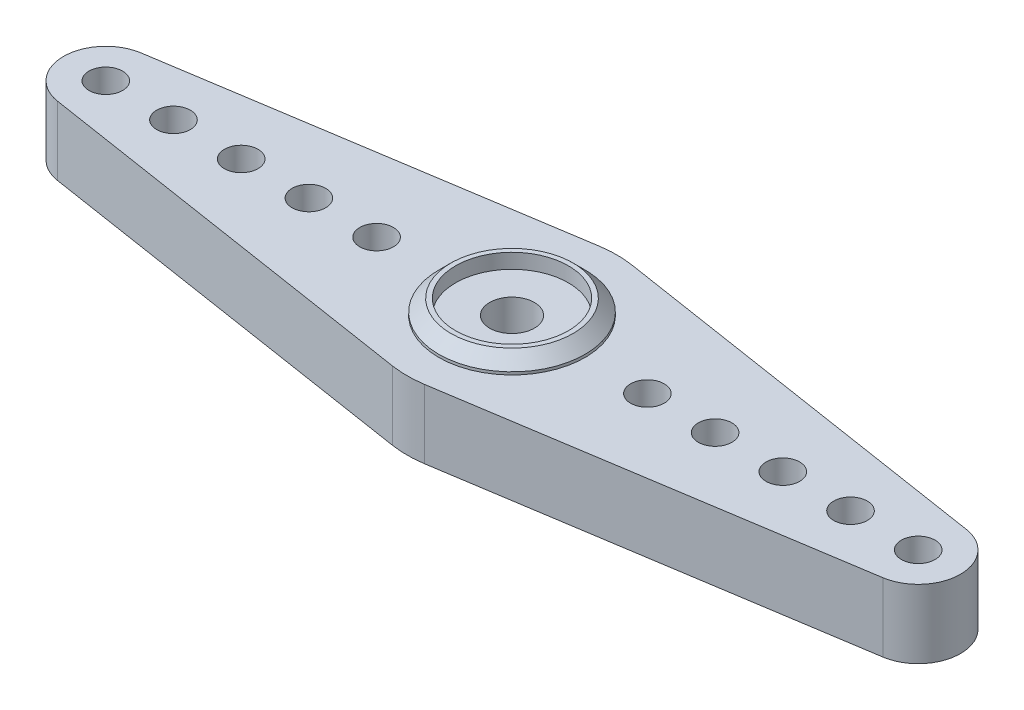
ISO-10303-21;
HEADER;
FILE_DESCRIPTION(('STEP AP214'),'2;1');
FILE_NAME('part.step','',(''),(''),'','','');
FILE_SCHEMA(('AUTOMOTIVE_DESIGN { 1 0 10303 214 1 1 1 1 }'));
ENDSEC;
DATA;
#1=APPLICATION_CONTEXT('core data for automotive mechanical design processes');
#2=APPLICATION_PROTOCOL_DEFINITION('international standard','automotive_design',2000,#1);
#3=PRODUCT_CONTEXT('',#1,'mechanical');
#4=PRODUCT('Part','Part','',(#3));
#5=PRODUCT_RELATED_PRODUCT_CATEGORY('part','',(#4));
#6=PRODUCT_DEFINITION_FORMATION('','',#4);
#7=PRODUCT_DEFINITION_CONTEXT('part definition',#1,'design');
#8=PRODUCT_DEFINITION('design','',#6,#7);
#9=PRODUCT_DEFINITION_SHAPE('','',#8);
#10=(LENGTH_UNIT() NAMED_UNIT(*) SI_UNIT(.MILLI.,.METRE.));
#11=(NAMED_UNIT(*) PLANE_ANGLE_UNIT() SI_UNIT($,.RADIAN.));
#12=(NAMED_UNIT(*) SI_UNIT($,.STERADIAN.) SOLID_ANGLE_UNIT());
#13=UNCERTAINTY_MEASURE_WITH_UNIT(LENGTH_MEASURE(1.E-05),#10,'distance_accuracy_value','');
#14=(GEOMETRIC_REPRESENTATION_CONTEXT(3) GLOBAL_UNCERTAINTY_ASSIGNED_CONTEXT((#13)) GLOBAL_UNIT_ASSIGNED_CONTEXT((#10,
#11,#12)) REPRESENTATION_CONTEXT('',''));
#15=CARTESIAN_POINT('',(0.,0.,0.));
#16=DIRECTION('',(0.,0.,1.));
#17=DIRECTION('',(1.,0.,0.));
#18=AXIS2_PLACEMENT_3D('',#15,#16,#17);
#19=CARTESIAN_POINT('',(-30.0228,0.,0.));
#20=DIRECTION('',(0.,1.,0.));
#21=DIRECTION('',(0.,0.,1.));
#22=AXIS2_PLACEMENT_3D('',#19,#20,#21);
#23=PLANE('',#22);
#24=CARTESIAN_POINT('',(0.,0.,0.));
#25=DIRECTION('',(0.,1.,0.));
#26=DIRECTION('',(0.,0.,1.));
#27=AXIS2_PLACEMENT_3D('',#24,#25,#26);
#28=CIRCLE('',#27,1.651);
#29=CARTESIAN_POINT('',(0.,0.,1.651));
#30=VERTEX_POINT('',#29);
#31=EDGE_CURVE('E301',#30,#30,#28,.T.);
#32=ORIENTED_EDGE('',*,*,#31,.T.);
#33=EDGE_LOOP('',(#32));
#34=FACE_BOUND('',#33,.T.);
#35=CARTESIAN_POINT('',(0.,0.,0.));
#36=DIRECTION('',(0.,-1.,0.));
#37=DIRECTION('',(0.,0.,-1.));
#38=AXIS2_PLACEMENT_3D('',#35,#36,#37);
#39=CIRCLE('',#38,4.1656);
#40=CARTESIAN_POINT('',(0.,0.,-4.1656));
#41=VERTEX_POINT('',#40);
#42=EDGE_CURVE('E373',#41,#41,#39,.T.);
#43=ORIENTED_EDGE('',*,*,#42,.T.);
#44=EDGE_LOOP('',(#43));
#45=FACE_BOUND('',#44,.T.);
#46=ADVANCED_FACE('F33',(#34,#45),#23,.F.);
#47=CARTESIAN_POINT('',(-30.0228,5.08,0.));
#48=DIRECTION('',(0.,1.,0.));
#49=DIRECTION('',(0.,0.,1.));
#50=AXIS2_PLACEMENT_3D('',#47,#48,#49);
#51=PLANE('',#50);
#52=CARTESIAN_POINT('',(0.,5.08,0.));
#53=DIRECTION('',(0.,1.,0.));
#54=DIRECTION('',(0.,0.,1.));
#55=AXIS2_PLACEMENT_3D('',#52,#53,#54);
#56=CIRCLE('',#55,1.651);
#57=CARTESIAN_POINT('',(0.,5.08,1.651));
#58=VERTEX_POINT('',#57);
#59=EDGE_CURVE('E136',#58,#58,#56,.T.);
#60=ORIENTED_EDGE('',*,*,#59,.F.);
#61=EDGE_LOOP('',(#60));
#62=FACE_BOUND('',#61,.T.);
#63=CARTESIAN_POINT('',(0.,5.08,0.));
#64=DIRECTION('',(0.,1.,0.));
#65=DIRECTION('',(0.,0.,1.));
#66=AXIS2_PLACEMENT_3D('',#63,#64,#65);
#67=CIRCLE('',#66,4.1656);
#68=CARTESIAN_POINT('',(0.,5.08,4.1656));
#69=VERTEX_POINT('',#68);
#70=EDGE_CURVE('E162',#69,#69,#67,.F.);
#71=ORIENTED_EDGE('',*,*,#70,.F.);
#72=EDGE_LOOP('',(#71));
#73=FACE_BOUND('',#72,.T.);
#74=ADVANCED_FACE('F190',(#62,#73),#51,.T.);
#75=CARTESIAN_POINT('',(0.,5.08,0.));
#76=DIRECTION('',(0.,1.,0.));
#77=DIRECTION('',(0.,0.,1.));
#78=AXIS2_PLACEMENT_3D('',#75,#76,#77);
#79=CIRCLE('',#78,5.40385);
#80=CARTESIAN_POINT('',(0.,5.08,5.40385));
#81=VERTEX_POINT('',#80);
#82=EDGE_CURVE('E258',#81,#81,#79,.T.);
#83=ORIENTED_EDGE('',*,*,#82,.F.);
#84=EDGE_LOOP('',(#83));
#85=FACE_BOUND('',#84,.T.);
#86=CARTESIAN_POINT('',(15.0114,5.08,0.));
#87=DIRECTION('',(0.,1.,0.));
#88=DIRECTION('',(0.,0.,-1.));
#89=AXIS2_PLACEMENT_3D('',#86,#87,#88);
#90=CIRCLE('',#89,1.2446);
#91=CARTESIAN_POINT('',(15.0114,5.08,-1.2446));
#92=VERTEX_POINT('',#91);
#93=EDGE_CURVE('E266',#92,#92,#90,.T.);
#94=ORIENTED_EDGE('',*,*,#93,.F.);
#95=EDGE_LOOP('',(#94));
#96=FACE_BOUND('',#95,.T.);
#97=CARTESIAN_POINT('',(25.019,5.08,0.));
#98=DIRECTION('',(0.,1.,0.));
#99=DIRECTION('',(0.,0.,-1.));
#100=AXIS2_PLACEMENT_3D('',#97,#98,#99);
#101=CIRCLE('',#100,1.2446);
#102=CARTESIAN_POINT('',(25.019,5.08,-1.2446));
#103=VERTEX_POINT('',#102);
#104=EDGE_CURVE('E274',#103,#103,#101,.T.);
#105=ORIENTED_EDGE('',*,*,#104,.F.);
#106=EDGE_LOOP('',(#105));
#107=FACE_BOUND('',#106,.T.);
#108=CARTESIAN_POINT('',(-30.0228,5.08,0.));
#109=DIRECTION('',(0.,1.,0.));
#110=DIRECTION('',(0.,0.,1.));
#111=AXIS2_PLACEMENT_3D('',#108,#109,#110);
#112=CIRCLE('',#111,1.2446);
#113=CARTESIAN_POINT('',(-30.0228,5.08,1.2446));
#114=VERTEX_POINT('',#113);
#115=EDGE_CURVE('E282',#114,#114,#112,.T.);
#116=ORIENTED_EDGE('',*,*,#115,.F.);
#117=EDGE_LOOP('',(#116));
#118=FACE_BOUND('',#117,.T.);
#119=CARTESIAN_POINT('',(-20.0152,5.08,0.));
#120=DIRECTION('',(0.,1.,0.));
#121=DIRECTION('',(0.,0.,1.));
#122=AXIS2_PLACEMENT_3D('',#119,#120,#121);
#123=CIRCLE('',#122,1.2446);
#124=CARTESIAN_POINT('',(-20.0152,5.08,1.2446));
#125=VERTEX_POINT('',#124);
#126=EDGE_CURVE('E290',#125,#125,#123,.T.);
#127=ORIENTED_EDGE('',*,*,#126,.F.);
#128=EDGE_LOOP('',(#127));
#129=FACE_BOUND('',#128,.T.);
#130=CARTESIAN_POINT('',(-10.0076,5.08,0.));
#131=DIRECTION('',(0.,1.,0.));
#132=DIRECTION('',(0.,0.,1.));
#133=AXIS2_PLACEMENT_3D('',#130,#131,#132);
#134=CIRCLE('',#133,1.2446);
#135=CARTESIAN_POINT('',(-10.0076,5.08,1.2446));
#136=VERTEX_POINT('',#135);
#137=EDGE_CURVE('E298',#136,#136,#134,.T.);
#138=ORIENTED_EDGE('',*,*,#137,.F.);
#139=EDGE_LOOP('',(#138));
#140=FACE_BOUND('',#139,.T.);
#141=CARTESIAN_POINT('',(-30.0228,5.08,0.));
#142=DIRECTION('',(0.,1.,0.));
#143=DIRECTION('',(0.,0.,1.));
#144=AXIS2_PLACEMENT_3D('',#141,#142,#143);
#145=CIRCLE('',#144,3.1242);
#146=CARTESIAN_POINT('',(-30.5038527918782,5.08,-3.08694247620946));
#147=VERTEX_POINT('',#146);
#148=CARTESIAN_POINT('',(-30.5038527918782,5.08,3.08694247620947));
#149=VERTEX_POINT('',#148);
#150=EDGE_CURVE('E147',#147,#149,#145,.T.);
#151=ORIENTED_EDGE('',*,*,#150,.T.);
#152=DIRECTION('',(0.988074539469133,0.,0.153976311336717));
#153=VECTOR('',#152,1.);
#154=CARTESIAN_POINT('',(-30.5038527918782,5.08,3.08694247620947));
#155=LINE('',#154,#153);
#156=CARTESIAN_POINT('',(-1.19285448392555,5.08,7.65461345726737));
#157=VERTEX_POINT('',#156);
#158=EDGE_CURVE('E94',#149,#157,#155,.T.);
#159=ORIENTED_EDGE('',*,*,#158,.T.);
#160=CARTESIAN_POINT('',(0.,5.08,0.));
#161=DIRECTION('',(0.,1.,0.));
#162=DIRECTION('',(0.,0.,1.));
#163=AXIS2_PLACEMENT_3D('',#160,#161,#162);
#164=CIRCLE('',#163,7.747);
#165=CARTESIAN_POINT('',(1.19285448392555,5.08,7.65461345726737));
#166=VERTEX_POINT('',#165);
#167=EDGE_CURVE('E308',#157,#166,#164,.T.);
#168=ORIENTED_EDGE('',*,*,#167,.T.);
#169=DIRECTION('',(0.988074539469133,0.,-0.153976311336717));
#170=VECTOR('',#169,1.);
#171=CARTESIAN_POINT('',(30.5038527918782,5.08,3.08694247620947));
#172=LINE('',#171,#170);
#173=CARTESIAN_POINT('',(30.5038527918782,5.08,3.08694247620947));
#174=VERTEX_POINT('',#173);
#175=EDGE_CURVE('E310',#166,#174,#172,.T.);
#176=ORIENTED_EDGE('',*,*,#175,.T.);
#177=CARTESIAN_POINT('',(30.0228,5.08,0.));
#178=DIRECTION('',(0.,1.,0.));
#179=DIRECTION('',(0.,0.,-1.));
#180=AXIS2_PLACEMENT_3D('',#177,#178,#179);
#181=CIRCLE('',#180,3.1242);
#182=CARTESIAN_POINT('',(30.5038527918782,5.08,-3.08694247620946));
#183=VERTEX_POINT('',#182);
#184=EDGE_CURVE('E114',#174,#183,#181,.T.);
#185=ORIENTED_EDGE('',*,*,#184,.T.);
#186=DIRECTION('',(-0.988074539469132,0.,-0.153976311336717));
#187=VECTOR('',#186,1.);
#188=CARTESIAN_POINT('',(30.5038527918782,5.08,-3.08694247620946));
#189=LINE('',#188,#187);
#190=CARTESIAN_POINT('',(1.19285448392555,5.08,-7.65461345726737));
#191=VERTEX_POINT('',#190);
#192=EDGE_CURVE('E107',#183,#191,#189,.T.);
#193=ORIENTED_EDGE('',*,*,#192,.T.);
#194=CARTESIAN_POINT('',(0.,5.08,0.));
#195=DIRECTION('',(0.,1.,0.));
#196=DIRECTION('',(0.,0.,1.));
#197=AXIS2_PLACEMENT_3D('',#194,#195,#196);
#198=CIRCLE('',#197,7.747);
#199=CARTESIAN_POINT('',(-1.19285448392555,5.08,-7.65461345726737));
#200=VERTEX_POINT('',#199);
#201=EDGE_CURVE('E112',#191,#200,#198,.T.);
#202=ORIENTED_EDGE('',*,*,#201,.T.);
#203=DIRECTION('',(-0.988074539469132,0.,0.153976311336717));
#204=VECTOR('',#203,1.);
#205=CARTESIAN_POINT('',(-30.5038527918782,5.08,-3.08694247620946));
#206=LINE('',#205,#204);
#207=EDGE_CURVE('E50',#200,#147,#206,.T.);
#208=ORIENTED_EDGE('',*,*,#207,.T.);
#209=EDGE_LOOP('',(#151,#159,#168,#176,#185,#193,#202,#208));
#210=FACE_BOUND('',#209,.T.);
#211=CARTESIAN_POINT('',(-15.0114,5.08,0.));
#212=DIRECTION('',(0.,1.,0.));
#213=DIRECTION('',(0.,0.,1.));
#214=AXIS2_PLACEMENT_3D('',#211,#212,#213);
#215=CIRCLE('',#214,1.2446);
#216=CARTESIAN_POINT('',(-15.0114,5.08,1.2446));
#217=VERTEX_POINT('',#216);
#218=EDGE_CURVE('E294',#217,#217,#215,.T.);
#219=ORIENTED_EDGE('',*,*,#218,.F.);
#220=EDGE_LOOP('',(#219));
#221=FACE_BOUND('',#220,.T.);
#222=CARTESIAN_POINT('',(-25.019,5.08,0.));
#223=DIRECTION('',(0.,1.,0.));
#224=DIRECTION('',(0.,0.,1.));
#225=AXIS2_PLACEMENT_3D('',#222,#223,#224);
#226=CIRCLE('',#225,1.2446);
#227=CARTESIAN_POINT('',(-25.019,5.08,1.2446));
#228=VERTEX_POINT('',#227);
#229=EDGE_CURVE('E286',#228,#228,#226,.T.);
#230=ORIENTED_EDGE('',*,*,#229,.F.);
#231=EDGE_LOOP('',(#230));
#232=FACE_BOUND('',#231,.T.);
#233=CARTESIAN_POINT('',(30.0228,5.08,0.));
#234=DIRECTION('',(0.,1.,0.));
#235=DIRECTION('',(0.,0.,-1.));
#236=AXIS2_PLACEMENT_3D('',#233,#234,#235);
#237=CIRCLE('',#236,1.2446);
#238=CARTESIAN_POINT('',(30.0228,5.08,-1.24459999999999));
#239=VERTEX_POINT('',#238);
#240=EDGE_CURVE('E278',#239,#239,#237,.T.);
#241=ORIENTED_EDGE('',*,*,#240,.F.);
#242=EDGE_LOOP('',(#241));
#243=FACE_BOUND('',#242,.T.);
#244=CARTESIAN_POINT('',(20.0152,5.08,0.));
#245=DIRECTION('',(0.,1.,0.));
#246=DIRECTION('',(0.,0.,-1.));
#247=AXIS2_PLACEMENT_3D('',#244,#245,#246);
#248=CIRCLE('',#247,1.2446);
#249=CARTESIAN_POINT('',(20.0152,5.08,-1.2446));
#250=VERTEX_POINT('',#249);
#251=EDGE_CURVE('E270',#250,#250,#248,.T.);
#252=ORIENTED_EDGE('',*,*,#251,.F.);
#253=EDGE_LOOP('',(#252));
#254=FACE_BOUND('',#253,.T.);
#255=CARTESIAN_POINT('',(10.0076,5.08,0.));
#256=DIRECTION('',(0.,1.,0.));
#257=DIRECTION('',(0.,0.,-1.));
#258=AXIS2_PLACEMENT_3D('',#255,#256,#257);
#259=CIRCLE('',#258,1.2446);
#260=CARTESIAN_POINT('',(10.0076,5.08,-1.2446));
#261=VERTEX_POINT('',#260);
#262=EDGE_CURVE('E257',#261,#261,#259,.T.);
#263=ORIENTED_EDGE('',*,*,#262,.F.);
#264=EDGE_LOOP('',(#263));
#265=FACE_BOUND('',#264,.T.);
#266=ADVANCED_FACE('F109',(#85,#96,#107,#118,#129,#140,#210,#221,#232,#243,#254,#265),#51,.T.);
#267=CARTESIAN_POINT('',(0.,0.,0.));
#268=DIRECTION('',(0.,1.,0.));
#269=DIRECTION('',(0.,0.,1.));
#270=AXIS2_PLACEMENT_3D('',#267,#268,#269);
#271=CIRCLE('',#270,5.4102);
#272=CARTESIAN_POINT('',(0.,0.,5.4102));
#273=VERTEX_POINT('',#272);
#274=EDGE_CURVE('E171',#273,#273,#271,.F.);
#275=ORIENTED_EDGE('',*,*,#274,.F.);
#276=EDGE_LOOP('',(#275));
#277=FACE_BOUND('',#276,.T.);
#278=CARTESIAN_POINT('',(-30.0228,0.,0.));
#279=DIRECTION('',(0.,1.,0.));
#280=DIRECTION('',(0.,0.,1.));
#281=AXIS2_PLACEMENT_3D('',#278,#279,#280);
#282=CIRCLE('',#281,3.1242);
#283=CARTESIAN_POINT('',(-30.5038527918782,0.,-3.08694247620946));
#284=VERTEX_POINT('',#283);
#285=CARTESIAN_POINT('',(-30.5038527918782,0.,3.08694247620947));
#286=VERTEX_POINT('',#285);
#287=EDGE_CURVE('E132',#284,#286,#282,.T.);
#288=ORIENTED_EDGE('',*,*,#287,.F.);
#289=DIRECTION('',(-0.988074539469132,0.,0.153976311336717));
#290=VECTOR('',#289,1.);
#291=CARTESIAN_POINT('',(-30.5038527918782,0.,-3.08694247620946));
#292=LINE('',#291,#290);
#293=CARTESIAN_POINT('',(-1.19285448392555,0.,-7.65461345726737));
#294=VERTEX_POINT('',#293);
#295=EDGE_CURVE('E85',#294,#284,#292,.T.);
#296=ORIENTED_EDGE('',*,*,#295,.F.);
#297=CARTESIAN_POINT('',(0.,0.,0.));
#298=DIRECTION('',(0.,1.,0.));
#299=DIRECTION('',(0.,0.,1.));
#300=AXIS2_PLACEMENT_3D('',#297,#298,#299);
#301=CIRCLE('',#300,7.747);
#302=CARTESIAN_POINT('',(1.19285448392555,0.,-7.65461345726737));
#303=VERTEX_POINT('',#302);
#304=EDGE_CURVE('E79',#303,#294,#301,.T.);
#305=ORIENTED_EDGE('',*,*,#304,.F.);
#306=DIRECTION('',(-0.988074539469132,0.,-0.153976311336717));
#307=VECTOR('',#306,1.);
#308=CARTESIAN_POINT('',(30.5038527918782,0.,-3.08694247620946));
#309=LINE('',#308,#307);
#310=CARTESIAN_POINT('',(30.5038527918782,0.,-3.08694247620946));
#311=VERTEX_POINT('',#310);
#312=EDGE_CURVE('E122',#311,#303,#309,.T.);
#313=ORIENTED_EDGE('',*,*,#312,.F.);
#314=CARTESIAN_POINT('',(30.0228,0.,0.));
#315=DIRECTION('',(0.,1.,0.));
#316=DIRECTION('',(0.,0.,-1.));
#317=AXIS2_PLACEMENT_3D('',#314,#315,#316);
#318=CIRCLE('',#317,3.1242);
#319=CARTESIAN_POINT('',(30.5038527918782,0.,3.08694247620947));
#320=VERTEX_POINT('',#319);
#321=EDGE_CURVE('E142',#320,#311,#318,.T.);
#322=ORIENTED_EDGE('',*,*,#321,.F.);
#323=DIRECTION('',(0.988074539469133,0.,-0.153976311336717));
#324=VECTOR('',#323,1.);
#325=CARTESIAN_POINT('',(30.5038527918782,0.,3.08694247620947));
#326=LINE('',#325,#324);
#327=CARTESIAN_POINT('',(1.19285448392555,0.,7.65461345726737));
#328=VERTEX_POINT('',#327);
#329=EDGE_CURVE('E140',#328,#320,#326,.T.);
#330=ORIENTED_EDGE('',*,*,#329,.F.);
#331=CARTESIAN_POINT('',(0.,0.,0.));
#332=DIRECTION('',(0.,1.,0.));
#333=DIRECTION('',(0.,0.,1.));
#334=AXIS2_PLACEMENT_3D('',#331,#332,#333);
#335=CIRCLE('',#334,7.747);
#336=CARTESIAN_POINT('',(-1.19285448392555,0.,7.65461345726737));
#337=VERTEX_POINT('',#336);
#338=EDGE_CURVE('E138',#337,#328,#335,.T.);
#339=ORIENTED_EDGE('',*,*,#338,.F.);
#340=DIRECTION('',(0.988074539469133,0.,0.153976311336717));
#341=VECTOR('',#340,1.);
#342=CARTESIAN_POINT('',(-30.5038527918782,0.,3.08694247620947));
#343=LINE('',#342,#341);
#344=EDGE_CURVE('E135',#286,#337,#343,.T.);
#345=ORIENTED_EDGE('',*,*,#344,.F.);
#346=EDGE_LOOP('',(#288,#296,#305,#313,#322,#330,#339,#345));
#347=FACE_BOUND('',#346,.T.);
#348=CARTESIAN_POINT('',(-10.0076,0.,0.));
#349=DIRECTION('',(0.,1.,0.));
#350=DIRECTION('',(0.,0.,1.));
#351=AXIS2_PLACEMENT_3D('',#348,#349,#350);
#352=CIRCLE('',#351,1.2446);
#353=CARTESIAN_POINT('',(-10.0076,0.,1.2446));
#354=VERTEX_POINT('',#353);
#355=EDGE_CURVE('E220',#354,#354,#352,.T.);
#356=ORIENTED_EDGE('',*,*,#355,.T.);
#357=EDGE_LOOP('',(#356));
#358=FACE_BOUND('',#357,.T.);
#359=CARTESIAN_POINT('',(-15.0114,0.,0.));
#360=DIRECTION('',(0.,1.,0.));
#361=DIRECTION('',(0.,0.,1.));
#362=AXIS2_PLACEMENT_3D('',#359,#360,#361);
#363=CIRCLE('',#362,1.2446);
#364=CARTESIAN_POINT('',(-15.0114,0.,1.2446));
#365=VERTEX_POINT('',#364);
#366=EDGE_CURVE('E224',#365,#365,#363,.T.);
#367=ORIENTED_EDGE('',*,*,#366,.T.);
#368=EDGE_LOOP('',(#367));
#369=FACE_BOUND('',#368,.T.);
#370=CARTESIAN_POINT('',(-20.0152,0.,0.));
#371=DIRECTION('',(0.,1.,0.));
#372=DIRECTION('',(0.,0.,1.));
#373=AXIS2_PLACEMENT_3D('',#370,#371,#372);
#374=CIRCLE('',#373,1.2446);
#375=CARTESIAN_POINT('',(-20.0152,0.,1.2446));
#376=VERTEX_POINT('',#375);
#377=EDGE_CURVE('E228',#376,#376,#374,.T.);
#378=ORIENTED_EDGE('',*,*,#377,.T.);
#379=EDGE_LOOP('',(#378));
#380=FACE_BOUND('',#379,.T.);
#381=CARTESIAN_POINT('',(-25.019,0.,0.));
#382=DIRECTION('',(0.,1.,0.));
#383=DIRECTION('',(0.,0.,1.));
#384=AXIS2_PLACEMENT_3D('',#381,#382,#383);
#385=CIRCLE('',#384,1.2446);
#386=CARTESIAN_POINT('',(-25.019,0.,1.2446));
#387=VERTEX_POINT('',#386);
#388=EDGE_CURVE('E232',#387,#387,#385,.T.);
#389=ORIENTED_EDGE('',*,*,#388,.T.);
#390=EDGE_LOOP('',(#389));
#391=FACE_BOUND('',#390,.T.);
#392=CARTESIAN_POINT('',(-30.0228,0.,0.));
#393=DIRECTION('',(0.,1.,0.));
#394=DIRECTION('',(0.,0.,1.));
#395=AXIS2_PLACEMENT_3D('',#392,#393,#394);
#396=CIRCLE('',#395,1.2446);
#397=CARTESIAN_POINT('',(-30.0228,0.,1.2446));
#398=VERTEX_POINT('',#397);
#399=EDGE_CURVE('E236',#398,#398,#396,.T.);
#400=ORIENTED_EDGE('',*,*,#399,.T.);
#401=EDGE_LOOP('',(#400));
#402=FACE_BOUND('',#401,.T.);
#403=CARTESIAN_POINT('',(30.0228,0.,0.));
#404=DIRECTION('',(0.,1.,0.));
#405=DIRECTION('',(0.,0.,-1.));
#406=AXIS2_PLACEMENT_3D('',#403,#404,#405);
#407=CIRCLE('',#406,1.2446);
#408=CARTESIAN_POINT('',(30.0228,0.,-1.24459999999999));
#409=VERTEX_POINT('',#408);
#410=EDGE_CURVE('E240',#409,#409,#407,.T.);
#411=ORIENTED_EDGE('',*,*,#410,.T.);
#412=EDGE_LOOP('',(#411));
#413=FACE_BOUND('',#412,.T.);
#414=CARTESIAN_POINT('',(25.019,0.,0.));
#415=DIRECTION('',(0.,1.,0.));
#416=DIRECTION('',(0.,0.,-1.));
#417=AXIS2_PLACEMENT_3D('',#414,#415,#416);
#418=CIRCLE('',#417,1.2446);
#419=CARTESIAN_POINT('',(25.019,0.,-1.2446));
#420=VERTEX_POINT('',#419);
#421=EDGE_CURVE('E244',#420,#420,#418,.T.);
#422=ORIENTED_EDGE('',*,*,#421,.T.);
#423=EDGE_LOOP('',(#422));
#424=FACE_BOUND('',#423,.T.);
#425=CARTESIAN_POINT('',(20.0152,0.,0.));
#426=DIRECTION('',(0.,1.,0.));
#427=DIRECTION('',(0.,0.,-1.));
#428=AXIS2_PLACEMENT_3D('',#425,#426,#427);
#429=CIRCLE('',#428,1.2446);
#430=CARTESIAN_POINT('',(20.0152,0.,-1.2446));
#431=VERTEX_POINT('',#430);
#432=EDGE_CURVE('E248',#431,#431,#429,.T.);
#433=ORIENTED_EDGE('',*,*,#432,.T.);
#434=EDGE_LOOP('',(#433));
#435=FACE_BOUND('',#434,.T.);
#436=CARTESIAN_POINT('',(15.0114,0.,0.));
#437=DIRECTION('',(0.,1.,0.));
#438=DIRECTION('',(0.,0.,-1.));
#439=AXIS2_PLACEMENT_3D('',#436,#437,#438);
#440=CIRCLE('',#439,1.2446);
#441=CARTESIAN_POINT('',(15.0114,0.,-1.2446));
#442=VERTEX_POINT('',#441);
#443=EDGE_CURVE('E252',#442,#442,#440,.T.);
#444=ORIENTED_EDGE('',*,*,#443,.T.);
#445=EDGE_LOOP('',(#444));
#446=FACE_BOUND('',#445,.T.);
#447=CARTESIAN_POINT('',(10.0076,0.,0.));
#448=DIRECTION('',(0.,1.,0.));
#449=DIRECTION('',(0.,0.,-1.));
#450=AXIS2_PLACEMENT_3D('',#447,#448,#449);
#451=CIRCLE('',#450,1.2446);
#452=CARTESIAN_POINT('',(10.0076,0.,-1.2446));
#453=VERTEX_POINT('',#452);
#454=EDGE_CURVE('E255',#453,#453,#451,.T.);
#455=ORIENTED_EDGE('',*,*,#454,.T.);
#456=EDGE_LOOP('',(#455));
#457=FACE_BOUND('',#456,.T.);
#458=ADVANCED_FACE('F193',(#277,#347,#358,#369,#380,#391,#402,#413,#424,#435,#446,#457),#23,.F.);
#459=CARTESIAN_POINT('',(-30.0228,5.08,0.));
#460=DIRECTION('',(0.,-1.,0.));
#461=DIRECTION('',(0.,0.,-1.));
#462=AXIS2_PLACEMENT_3D('',#459,#460,#461);
#463=CYLINDRICAL_SURFACE('',#462,3.1242);
#464=ORIENTED_EDGE('',*,*,#287,.T.);
#465=DIRECTION('',(0.,-1.,0.));
#466=VECTOR('',#465,1.);
#467=CARTESIAN_POINT('',(-30.5038527918782,5.08,3.08694247620947));
#468=LINE('',#467,#466);
#469=EDGE_CURVE('E160',#149,#286,#468,.T.);
#470=ORIENTED_EDGE('',*,*,#469,.F.);
#471=ORIENTED_EDGE('',*,*,#150,.F.);
#472=DIRECTION('',(0.,-1.,0.));
#473=VECTOR('',#472,1.);
#474=CARTESIAN_POINT('',(-30.5038527918782,5.08,-3.08694247620946));
#475=LINE('',#474,#473);
#476=EDGE_CURVE('E128',#147,#284,#475,.T.);
#477=ORIENTED_EDGE('',*,*,#476,.T.);
#478=EDGE_LOOP('',(#464,#470,#471,#477));
#479=FACE_BOUND('',#478,.T.);
#480=ADVANCED_FACE('F203',(#479),#463,.T.);
#481=CARTESIAN_POINT('',(-30.5038527918782,5.08,3.08694247620947));
#482=DIRECTION('',(0.153976311336717,0.,-0.988074539469132));
#483=DIRECTION('',(-0.988074539469133,0.,-0.153976311336717));
#484=AXIS2_PLACEMENT_3D('',#481,#482,#483);
#485=PLANE('',#484);
#486=ORIENTED_EDGE('',*,*,#344,.T.);
#487=DIRECTION('',(0.,-1.,0.));
#488=VECTOR('',#487,1.);
#489=CARTESIAN_POINT('',(-1.19285448392555,5.08,7.65461345726737));
#490=LINE('',#489,#488);
#491=EDGE_CURVE('E157',#157,#337,#490,.T.);
#492=ORIENTED_EDGE('',*,*,#491,.F.);
#493=ORIENTED_EDGE('',*,*,#158,.F.);
#494=ORIENTED_EDGE('',*,*,#469,.T.);
#495=EDGE_LOOP('',(#486,#492,#493,#494));
#496=FACE_BOUND('',#495,.T.);
#497=ADVANCED_FACE('F209',(#496),#485,.F.);
#498=CARTESIAN_POINT('',(0.,5.08,0.));
#499=DIRECTION('',(0.,-1.,0.));
#500=DIRECTION('',(0.,0.,-1.));
#501=AXIS2_PLACEMENT_3D('',#498,#499,#500);
#502=CYLINDRICAL_SURFACE('',#501,7.747);
#503=ORIENTED_EDGE('',*,*,#338,.T.);
#504=DIRECTION('',(0.,-1.,0.));
#505=VECTOR('',#504,1.);
#506=CARTESIAN_POINT('',(1.19285448392555,5.08,7.65461345726737));
#507=LINE('',#506,#505);
#508=EDGE_CURVE('E154',#166,#328,#507,.T.);
#509=ORIENTED_EDGE('',*,*,#508,.F.);
#510=ORIENTED_EDGE('',*,*,#167,.F.);
#511=ORIENTED_EDGE('',*,*,#491,.T.);
#512=EDGE_LOOP('',(#503,#509,#510,#511));
#513=FACE_BOUND('',#512,.T.);
#514=ADVANCED_FACE('F323',(#513),#502,.T.);
#515=CARTESIAN_POINT('',(30.5038527918782,5.08,3.08694247620947));
#516=DIRECTION('',(-0.153976311336717,0.,-0.988074539469132));
#517=DIRECTION('',(-0.988074539469133,0.,0.153976311336717));
#518=AXIS2_PLACEMENT_3D('',#515,#516,#517);
#519=PLANE('',#518);
#520=ORIENTED_EDGE('',*,*,#329,.T.);
#521=DIRECTION('',(0.,-1.,0.));
#522=VECTOR('',#521,1.);
#523=CARTESIAN_POINT('',(30.5038527918782,5.08,3.08694247620947));
#524=LINE('',#523,#522);
#525=EDGE_CURVE('E151',#174,#320,#524,.T.);
#526=ORIENTED_EDGE('',*,*,#525,.F.);
#527=ORIENTED_EDGE('',*,*,#175,.F.);
#528=ORIENTED_EDGE('',*,*,#508,.T.);
#529=EDGE_LOOP('',(#520,#526,#527,#528));
#530=FACE_BOUND('',#529,.T.);
#531=ADVANCED_FACE('F316',(#530),#519,.F.);
#532=CARTESIAN_POINT('',(30.0228,5.08,0.));
#533=DIRECTION('',(0.,-1.,0.));
#534=DIRECTION('',(0.,0.,-1.));
#535=AXIS2_PLACEMENT_3D('',#532,#533,#534);
#536=CYLINDRICAL_SURFACE('',#535,3.1242);
#537=ORIENTED_EDGE('',*,*,#321,.T.);
#538=DIRECTION('',(0.,-1.,0.));
#539=VECTOR('',#538,1.);
#540=CARTESIAN_POINT('',(30.5038527918782,5.08,-3.08694247620946));
#541=LINE('',#540,#539);
#542=EDGE_CURVE('E123',#183,#311,#541,.T.);
#543=ORIENTED_EDGE('',*,*,#542,.F.);
#544=ORIENTED_EDGE('',*,*,#184,.F.);
#545=ORIENTED_EDGE('',*,*,#525,.T.);
#546=EDGE_LOOP('',(#537,#543,#544,#545));
#547=FACE_BOUND('',#546,.T.);
#548=ADVANCED_FACE('F320',(#547),#536,.T.);
#549=CARTESIAN_POINT('',(30.5038527918782,5.08,-3.08694247620946));
#550=DIRECTION('',(-0.153976311336718,0.,0.988074539469132));
#551=DIRECTION('',(0.988074539469132,0.,0.153976311336718));
#552=AXIS2_PLACEMENT_3D('',#549,#550,#551);
#553=PLANE('',#552);
#554=ORIENTED_EDGE('',*,*,#312,.T.);
#555=DIRECTION('',(0.,-1.,0.));
#556=VECTOR('',#555,1.);
#557=CARTESIAN_POINT('',(1.19285448392555,5.08,-7.65461345726737));
#558=LINE('',#557,#556);
#559=EDGE_CURVE('E119',#191,#303,#558,.T.);
#560=ORIENTED_EDGE('',*,*,#559,.F.);
#561=ORIENTED_EDGE('',*,*,#192,.F.);
#562=ORIENTED_EDGE('',*,*,#542,.T.);
#563=EDGE_LOOP('',(#554,#560,#561,#562));
#564=FACE_BOUND('',#563,.T.);
#565=ADVANCED_FACE('F120',(#564),#553,.F.);
#566=CARTESIAN_POINT('',(0.,5.08,0.));
#567=DIRECTION('',(0.,-1.,0.));
#568=DIRECTION('',(0.,0.,-1.));
#569=AXIS2_PLACEMENT_3D('',#566,#567,#568);
#570=CYLINDRICAL_SURFACE('',#569,7.747);
#571=ORIENTED_EDGE('',*,*,#304,.T.);
#572=DIRECTION('',(0.,-1.,0.));
#573=VECTOR('',#572,1.);
#574=CARTESIAN_POINT('',(-1.19285448392555,5.08,-7.65461345726737));
#575=LINE('',#574,#573);
#576=EDGE_CURVE('E124',#200,#294,#575,.T.);
#577=ORIENTED_EDGE('',*,*,#576,.F.);
#578=ORIENTED_EDGE('',*,*,#201,.F.);
#579=ORIENTED_EDGE('',*,*,#559,.T.);
#580=EDGE_LOOP('',(#571,#577,#578,#579));
#581=FACE_BOUND('',#580,.T.);
#582=ADVANCED_FACE('F126',(#581),#570,.T.);
#583=CARTESIAN_POINT('',(-30.5038527918782,5.08,-3.08694247620946));
#584=DIRECTION('',(0.153976311336718,0.,0.988074539469132));
#585=DIRECTION('',(0.988074539469132,0.,-0.153976311336718));
#586=AXIS2_PLACEMENT_3D('',#583,#584,#585);
#587=PLANE('',#586);
#588=ORIENTED_EDGE('',*,*,#295,.T.);
#589=ORIENTED_EDGE('',*,*,#476,.F.);
#590=ORIENTED_EDGE('',*,*,#207,.F.);
#591=ORIENTED_EDGE('',*,*,#576,.T.);
#592=EDGE_LOOP('',(#588,#589,#590,#591));
#593=FACE_BOUND('',#592,.T.);
#594=ADVANCED_FACE('F326',(#593),#587,.F.);
#595=CARTESIAN_POINT('',(0.,5.08,0.));
#596=DIRECTION('',(0.,-1.,0.));
#597=DIRECTION('',(0.,0.,-1.));
#598=AXIS2_PLACEMENT_3D('',#595,#596,#597);
#599=CYLINDRICAL_SURFACE('',#598,1.651);
#600=ORIENTED_EDGE('',*,*,#59,.T.);
#601=EDGE_LOOP('',(#600));
#602=FACE_BOUND('',#601,.T.);
#603=ORIENTED_EDGE('',*,*,#31,.F.);
#604=EDGE_LOOP('',(#603));
#605=FACE_BOUND('',#604,.T.);
#606=ADVANCED_FACE('F328',(#602,#605),#599,.F.);
#607=CARTESIAN_POINT('',(-10.0076,5.08,0.));
#608=DIRECTION('',(0.,-1.,0.));
#609=DIRECTION('',(0.,0.,-1.));
#610=AXIS2_PLACEMENT_3D('',#607,#608,#609);
#611=CYLINDRICAL_SURFACE('',#610,1.2446);
#612=ORIENTED_EDGE('',*,*,#137,.T.);
#613=EDGE_LOOP('',(#612));
#614=FACE_BOUND('',#613,.T.);
#615=ORIENTED_EDGE('',*,*,#355,.F.);
#616=EDGE_LOOP('',(#615));
#617=FACE_BOUND('',#616,.T.);
#618=ADVANCED_FACE('F333',(#614,#617),#611,.F.);
#619=CARTESIAN_POINT('',(-15.0114,5.08,0.));
#620=DIRECTION('',(0.,-1.,0.));
#621=DIRECTION('',(0.,0.,-1.));
#622=AXIS2_PLACEMENT_3D('',#619,#620,#621);
#623=CYLINDRICAL_SURFACE('',#622,1.2446);
#624=ORIENTED_EDGE('',*,*,#218,.T.);
#625=EDGE_LOOP('',(#624));
#626=FACE_BOUND('',#625,.T.);
#627=ORIENTED_EDGE('',*,*,#366,.F.);
#628=EDGE_LOOP('',(#627));
#629=FACE_BOUND('',#628,.T.);
#630=ADVANCED_FACE('F420',(#626,#629),#623,.F.);
#631=CARTESIAN_POINT('',(-20.0152,5.08,0.));
#632=DIRECTION('',(0.,-1.,0.));
#633=DIRECTION('',(0.,0.,-1.));
#634=AXIS2_PLACEMENT_3D('',#631,#632,#633);
#635=CYLINDRICAL_SURFACE('',#634,1.2446);
#636=ORIENTED_EDGE('',*,*,#126,.T.);
#637=EDGE_LOOP('',(#636));
#638=FACE_BOUND('',#637,.T.);
#639=ORIENTED_EDGE('',*,*,#377,.F.);
#640=EDGE_LOOP('',(#639));
#641=FACE_BOUND('',#640,.T.);
#642=ADVANCED_FACE('F416',(#638,#641),#635,.F.);
#643=CARTESIAN_POINT('',(-25.019,5.08,0.));
#644=DIRECTION('',(0.,-1.,0.));
#645=DIRECTION('',(0.,0.,-1.));
#646=AXIS2_PLACEMENT_3D('',#643,#644,#645);
#647=CYLINDRICAL_SURFACE('',#646,1.2446);
#648=ORIENTED_EDGE('',*,*,#229,.T.);
#649=EDGE_LOOP('',(#648));
#650=FACE_BOUND('',#649,.T.);
#651=ORIENTED_EDGE('',*,*,#388,.F.);
#652=EDGE_LOOP('',(#651));
#653=FACE_BOUND('',#652,.T.);
#654=ADVANCED_FACE('F412',(#650,#653),#647,.F.);
#655=CARTESIAN_POINT('',(-30.0228,5.08,0.));
#656=DIRECTION('',(0.,-1.,0.));
#657=DIRECTION('',(0.,0.,-1.));
#658=AXIS2_PLACEMENT_3D('',#655,#656,#657);
#659=CYLINDRICAL_SURFACE('',#658,1.2446);
#660=ORIENTED_EDGE('',*,*,#115,.T.);
#661=EDGE_LOOP('',(#660));
#662=FACE_BOUND('',#661,.T.);
#663=ORIENTED_EDGE('',*,*,#399,.F.);
#664=EDGE_LOOP('',(#663));
#665=FACE_BOUND('',#664,.T.);
#666=ADVANCED_FACE('F408',(#662,#665),#659,.F.);
#667=CARTESIAN_POINT('',(30.0228,5.08,0.));
#668=DIRECTION('',(0.,-1.,0.));
#669=DIRECTION('',(0.,0.,-1.));
#670=AXIS2_PLACEMENT_3D('',#667,#668,#669);
#671=CYLINDRICAL_SURFACE('',#670,1.2446);
#672=ORIENTED_EDGE('',*,*,#240,.T.);
#673=EDGE_LOOP('',(#672));
#674=FACE_BOUND('',#673,.T.);
#675=ORIENTED_EDGE('',*,*,#410,.F.);
#676=EDGE_LOOP('',(#675));
#677=FACE_BOUND('',#676,.T.);
#678=ADVANCED_FACE('F404',(#674,#677),#671,.F.);
#679=CARTESIAN_POINT('',(25.019,5.08,0.));
#680=DIRECTION('',(0.,-1.,0.));
#681=DIRECTION('',(0.,0.,-1.));
#682=AXIS2_PLACEMENT_3D('',#679,#680,#681);
#683=CYLINDRICAL_SURFACE('',#682,1.2446);
#684=ORIENTED_EDGE('',*,*,#104,.T.);
#685=EDGE_LOOP('',(#684));
#686=FACE_BOUND('',#685,.T.);
#687=ORIENTED_EDGE('',*,*,#421,.F.);
#688=EDGE_LOOP('',(#687));
#689=FACE_BOUND('',#688,.T.);
#690=ADVANCED_FACE('F400',(#686,#689),#683,.F.);
#691=CARTESIAN_POINT('',(20.0152,5.08,0.));
#692=DIRECTION('',(0.,-1.,0.));
#693=DIRECTION('',(0.,0.,-1.));
#694=AXIS2_PLACEMENT_3D('',#691,#692,#693);
#695=CYLINDRICAL_SURFACE('',#694,1.2446);
#696=ORIENTED_EDGE('',*,*,#251,.T.);
#697=EDGE_LOOP('',(#696));
#698=FACE_BOUND('',#697,.T.);
#699=ORIENTED_EDGE('',*,*,#432,.F.);
#700=EDGE_LOOP('',(#699));
#701=FACE_BOUND('',#700,.T.);
#702=ADVANCED_FACE('F396',(#698,#701),#695,.F.);
#703=CARTESIAN_POINT('',(15.0114,5.08,0.));
#704=DIRECTION('',(0.,-1.,0.));
#705=DIRECTION('',(0.,0.,-1.));
#706=AXIS2_PLACEMENT_3D('',#703,#704,#705);
#707=CYLINDRICAL_SURFACE('',#706,1.2446);
#708=ORIENTED_EDGE('',*,*,#93,.T.);
#709=EDGE_LOOP('',(#708));
#710=FACE_BOUND('',#709,.T.);
#711=ORIENTED_EDGE('',*,*,#443,.F.);
#712=EDGE_LOOP('',(#711));
#713=FACE_BOUND('',#712,.T.);
#714=ADVANCED_FACE('F389',(#710,#713),#707,.F.);
#715=CARTESIAN_POINT('',(10.0076,5.08,0.));
#716=DIRECTION('',(0.,-1.,0.));
#717=DIRECTION('',(0.,0.,-1.));
#718=AXIS2_PLACEMENT_3D('',#715,#716,#717);
#719=CYLINDRICAL_SURFACE('',#718,1.2446);
#720=ORIENTED_EDGE('',*,*,#262,.T.);
#721=EDGE_LOOP('',(#720));
#722=FACE_BOUND('',#721,.T.);
#723=ORIENTED_EDGE('',*,*,#454,.F.);
#724=EDGE_LOOP('',(#723));
#725=FACE_BOUND('',#724,.T.);
#726=ADVANCED_FACE('F366',(#722,#725),#719,.F.);
#727=CARTESIAN_POINT('',(0.,6.1722,0.));
#728=DIRECTION('',(0.,1.,0.));
#729=DIRECTION('',(0.,0.,1.));
#730=AXIS2_PLACEMENT_3D('',#727,#728,#729);
#731=PLANE('',#730);
#732=CARTESIAN_POINT('',(0.,6.1722,0.));
#733=DIRECTION('',(0.,1.,0.));
#734=DIRECTION('',(0.,0.,1.));
#735=AXIS2_PLACEMENT_3D('',#732,#733,#734);
#736=CIRCLE('',#735,4.51484999999999);
#737=CARTESIAN_POINT('',(0.,6.1722,4.51484999999999));
#738=VERTEX_POINT('',#737);
#739=EDGE_CURVE('E165',#738,#738,#736,.T.);
#740=ORIENTED_EDGE('',*,*,#739,.T.);
#741=EDGE_LOOP('',(#740));
#742=FACE_BOUND('',#741,.T.);
#743=CARTESIAN_POINT('',(0.,6.1722,0.));
#744=DIRECTION('',(0.,1.,0.));
#745=DIRECTION('',(0.,0.,1.));
#746=AXIS2_PLACEMENT_3D('',#743,#744,#745);
#747=CIRCLE('',#746,4.1656);
#748=CARTESIAN_POINT('',(0.,6.1722,4.1656));
#749=VERTEX_POINT('',#748);
#750=EDGE_CURVE('E263',#749,#749,#747,.T.);
#751=ORIENTED_EDGE('',*,*,#750,.F.);
#752=EDGE_LOOP('',(#751));
#753=FACE_BOUND('',#752,.T.);
#754=ADVANCED_FACE('F363',(#742,#753),#731,.T.);
#755=CARTESIAN_POINT('',(0.,6.1722,0.));
#756=DIRECTION('',(0.,-1.,0.));
#757=DIRECTION('',(0.,0.,-1.));
#758=AXIS2_PLACEMENT_3D('',#755,#756,#757);
#759=CYLINDRICAL_SURFACE('',#758,5.40385);
#760=CARTESIAN_POINT('',(0.,5.28319999999998,0.));
#761=DIRECTION('',(0.,1.,0.));
#762=DIRECTION('',(0.,0.,1.));
#763=AXIS2_PLACEMENT_3D('',#760,#761,#762);
#764=CIRCLE('',#763,5.40385);
#765=CARTESIAN_POINT('',(0.,5.28319999999998,5.40385));
#766=VERTEX_POINT('',#765);
#767=EDGE_CURVE('E168',#766,#766,#764,.F.);
#768=ORIENTED_EDGE('',*,*,#767,.T.);
#769=EDGE_LOOP('',(#768));
#770=FACE_BOUND('',#769,.T.);
#771=ORIENTED_EDGE('',*,*,#82,.T.);
#772=EDGE_LOOP('',(#771));
#773=FACE_BOUND('',#772,.T.);
#774=ADVANCED_FACE('F356',(#770,#773),#759,.T.);
#775=CARTESIAN_POINT('',(0.,6.1722,0.));
#776=DIRECTION('',(0.,-1.,0.));
#777=DIRECTION('',(0.,0.,-1.));
#778=AXIS2_PLACEMENT_3D('',#775,#776,#777);
#779=CYLINDRICAL_SURFACE('',#778,4.1656);
#780=ORIENTED_EDGE('',*,*,#750,.T.);
#781=EDGE_LOOP('',(#780));
#782=FACE_BOUND('',#781,.T.);
#783=ORIENTED_EDGE('',*,*,#70,.T.);
#784=EDGE_LOOP('',(#783));
#785=FACE_BOUND('',#784,.T.);
#786=ADVANCED_FACE('F349',(#782,#785),#779,.F.);
#787=CARTESIAN_POINT('',(0.,6.1722,0.));
#788=DIRECTION('',(0.,-1.,0.));
#789=DIRECTION('',(0.,0.,-1.));
#790=AXIS2_PLACEMENT_3D('',#787,#788,#789);
#791=CONICAL_SURFACE('',#790,4.51484999999999,0.785398163397443);
#792=ORIENTED_EDGE('',*,*,#767,.F.);
#793=EDGE_LOOP('',(#792));
#794=FACE_BOUND('',#793,.T.);
#795=ORIENTED_EDGE('',*,*,#739,.F.);
#796=EDGE_LOOP('',(#795));
#797=FACE_BOUND('',#796,.T.);
#798=ADVANCED_FACE('F347',(#794,#797),#791,.T.);
#799=CARTESIAN_POINT('',(0.,-1.4986,0.));
#800=DIRECTION('',(0.,-1.,0.));
#801=DIRECTION('',(0.,0.,-1.));
#802=AXIS2_PLACEMENT_3D('',#799,#800,#801);
#803=PLANE('',#802);
#804=CARTESIAN_POINT('',(0.,-1.4986,0.));
#805=DIRECTION('',(0.,-1.,0.));
#806=DIRECTION('',(0.,0.,-1.));
#807=AXIS2_PLACEMENT_3D('',#804,#805,#806);
#808=CIRCLE('',#807,5.15620000000003);
#809=CARTESIAN_POINT('',(0.,-1.4986,-5.15620000000003));
#810=VERTEX_POINT('',#809);
#811=EDGE_CURVE('E42',#810,#810,#808,.T.);
#812=ORIENTED_EDGE('',*,*,#811,.T.);
#813=EDGE_LOOP('',(#812));
#814=FACE_BOUND('',#813,.T.);
#815=CARTESIAN_POINT('',(0.,-1.4986,0.));
#816=DIRECTION('',(0.,-1.,0.));
#817=DIRECTION('',(0.,0.,-1.));
#818=AXIS2_PLACEMENT_3D('',#815,#816,#817);
#819=CIRCLE('',#818,4.1656);
#820=CARTESIAN_POINT('',(0.,-1.4986,-4.1656));
#821=VERTEX_POINT('',#820);
#822=EDGE_CURVE('E370',#821,#821,#819,.T.);
#823=ORIENTED_EDGE('',*,*,#822,.F.);
#824=EDGE_LOOP('',(#823));
#825=FACE_BOUND('',#824,.T.);
#826=ADVANCED_FACE('F176',(#814,#825),#803,.T.);
#827=CARTESIAN_POINT('',(0.,-1.4986,0.));
#828=DIRECTION('',(0.,1.,0.));
#829=DIRECTION('',(0.,0.,1.));
#830=AXIS2_PLACEMENT_3D('',#827,#828,#829);
#831=CYLINDRICAL_SURFACE('',#830,5.4102);
#832=CARTESIAN_POINT('',(0.,-1.24460000000003,0.));
#833=DIRECTION('',(0.,-1.,0.));
#834=DIRECTION('',(0.,0.,-1.));
#835=AXIS2_PLACEMENT_3D('',#832,#833,#834);
#836=CIRCLE('',#835,5.4102);
#837=CARTESIAN_POINT('',(0.,-1.24460000000003,-5.4102));
#838=VERTEX_POINT('',#837);
#839=EDGE_CURVE('E11',#838,#838,#836,.F.);
#840=ORIENTED_EDGE('',*,*,#839,.T.);
#841=EDGE_LOOP('',(#840));
#842=FACE_BOUND('',#841,.T.);
#843=ORIENTED_EDGE('',*,*,#274,.T.);
#844=EDGE_LOOP('',(#843));
#845=FACE_BOUND('',#844,.T.);
#846=ADVANCED_FACE('F185',(#842,#845),#831,.T.);
#847=CARTESIAN_POINT('',(0.,-1.4986,0.));
#848=DIRECTION('',(0.,1.,0.));
#849=DIRECTION('',(0.,0.,1.));
#850=AXIS2_PLACEMENT_3D('',#847,#848,#849);
#851=CYLINDRICAL_SURFACE('',#850,4.1656);
#852=ORIENTED_EDGE('',*,*,#822,.T.);
#853=EDGE_LOOP('',(#852));
#854=FACE_BOUND('',#853,.T.);
#855=ORIENTED_EDGE('',*,*,#42,.F.);
#856=EDGE_LOOP('',(#855));
#857=FACE_BOUND('',#856,.T.);
#858=ADVANCED_FACE('F180',(#854,#857),#851,.F.);
#859=CARTESIAN_POINT('',(0.,-1.4986,0.));
#860=DIRECTION('',(0.,1.,0.));
#861=DIRECTION('',(0.,0.,1.));
#862=AXIS2_PLACEMENT_3D('',#859,#860,#861);
#863=CONICAL_SURFACE('',#862,5.15620000000003,0.785398163397452);
#864=ORIENTED_EDGE('',*,*,#839,.F.);
#865=EDGE_LOOP('',(#864));
#866=FACE_BOUND('',#865,.T.);
#867=ORIENTED_EDGE('',*,*,#811,.F.);
#868=EDGE_LOOP('',(#867));
#869=FACE_BOUND('',#868,.T.);
#870=ADVANCED_FACE('F35',(#866,#869),#863,.T.);
#871=CLOSED_SHELL('',(#46,#74,#266,#458,#480,#497,#514,#531,#548,#565,#582,#594,#606,#618,#630,
#642,#654,#666,#678,#690,#702,#714,#726,#754,#774,#786,#798,#826,#846,#858,#870));
#872=MANIFOLD_SOLID_BREP('B2',#871);
#873=ADVANCED_BREP_SHAPE_REPRESENTATION('',(#18,#872),#14);
#874=SHAPE_DEFINITION_REPRESENTATION(#9,#873);
ENDSEC;
END-ISO-10303-21;
